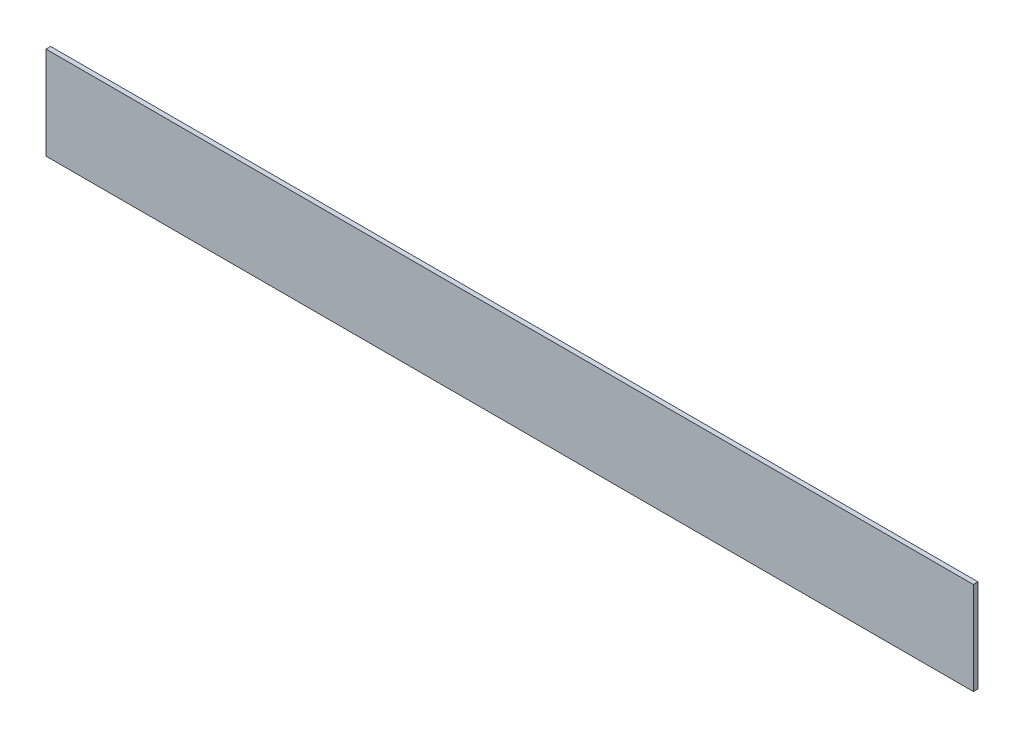
ISO-10303-21;
HEADER;
FILE_DESCRIPTION(('STEP AP214'),'2;1');
FILE_NAME('part.step','',(''),(''),'','','');
FILE_SCHEMA(('AUTOMOTIVE_DESIGN { 1 0 10303 214 1 1 1 1 }'));
ENDSEC;
DATA;
#1=APPLICATION_CONTEXT('core data for automotive mechanical design processes');
#2=APPLICATION_PROTOCOL_DEFINITION('international standard','automotive_design',2000,#1);
#3=PRODUCT_CONTEXT('',#1,'mechanical');
#4=PRODUCT('Part','Part','',(#3));
#5=PRODUCT_RELATED_PRODUCT_CATEGORY('part','',(#4));
#6=PRODUCT_DEFINITION_FORMATION('','',#4);
#7=PRODUCT_DEFINITION_CONTEXT('part definition',#1,'design');
#8=PRODUCT_DEFINITION('design','',#6,#7);
#9=PRODUCT_DEFINITION_SHAPE('','',#8);
#10=(LENGTH_UNIT() NAMED_UNIT(*) SI_UNIT(.MILLI.,.METRE.));
#11=(NAMED_UNIT(*) PLANE_ANGLE_UNIT() SI_UNIT($,.RADIAN.));
#12=(NAMED_UNIT(*) SI_UNIT($,.STERADIAN.) SOLID_ANGLE_UNIT());
#13=UNCERTAINTY_MEASURE_WITH_UNIT(LENGTH_MEASURE(1.E-05),#10,'distance_accuracy_value','');
#14=(GEOMETRIC_REPRESENTATION_CONTEXT(3) GLOBAL_UNCERTAINTY_ASSIGNED_CONTEXT((#13)) GLOBAL_UNIT_ASSIGNED_CONTEXT((#10,
#11,#12)) REPRESENTATION_CONTEXT('',''));
#15=CARTESIAN_POINT('',(0.,0.,0.));
#16=DIRECTION('',(0.,0.,1.));
#17=DIRECTION('',(1.,0.,0.));
#18=AXIS2_PLACEMENT_3D('',#15,#16,#17);
#19=CARTESIAN_POINT('',(0.,0.,-5.));
#20=DIRECTION('',(-1.,0.,0.));
#21=DIRECTION('',(0.,-1.,0.));
#22=AXIS2_PLACEMENT_3D('',#19,#20,#21);
#23=PLANE('',#22);
#24=DIRECTION('',(0.,-1.,0.));
#25=VECTOR('',#24,1.);
#26=CARTESIAN_POINT('',(0.,0.,0.));
#27=LINE('',#26,#25);
#28=CARTESIAN_POINT('',(0.,0.,0.));
#29=VERTEX_POINT('',#28);
#30=CARTESIAN_POINT('',(0.,-100.,0.));
#31=VERTEX_POINT('',#30);
#32=EDGE_CURVE('E102',#29,#31,#27,.T.);
#33=ORIENTED_EDGE('',*,*,#32,.F.);
#34=DIRECTION('',(0.,0.,1.));
#35=VECTOR('',#34,1.);
#36=CARTESIAN_POINT('',(0.,0.,-5.));
#37=LINE('',#36,#35);
#38=CARTESIAN_POINT('',(0.,0.,-5.));
#39=VERTEX_POINT('',#38);
#40=EDGE_CURVE('E11',#39,#29,#37,.T.);
#41=ORIENTED_EDGE('',*,*,#40,.F.);
#42=DIRECTION('',(0.,-1.,0.));
#43=VECTOR('',#42,1.);
#44=CARTESIAN_POINT('',(0.,0.,-5.));
#45=LINE('',#44,#43);
#46=CARTESIAN_POINT('',(0.,-100.,-5.));
#47=VERTEX_POINT('',#46);
#48=EDGE_CURVE('E96',#39,#47,#45,.T.);
#49=ORIENTED_EDGE('',*,*,#48,.T.);
#50=DIRECTION('',(0.,0.,1.));
#51=VECTOR('',#50,1.);
#52=CARTESIAN_POINT('',(0.,-100.,-5.));
#53=LINE('',#52,#51);
#54=EDGE_CURVE('E41',#47,#31,#53,.T.);
#55=ORIENTED_EDGE('',*,*,#54,.T.);
#56=EDGE_LOOP('',(#33,#41,#49,#55));
#57=FACE_BOUND('',#56,.T.);
#58=ADVANCED_FACE('F38',(#57),#23,.T.);
#59=CARTESIAN_POINT('',(0.,0.,-5.));
#60=DIRECTION('',(0.,1.,0.));
#61=DIRECTION('',(0.,0.,1.));
#62=AXIS2_PLACEMENT_3D('',#59,#60,#61);
#63=PLANE('',#62);
#64=DIRECTION('',(-1.,0.,0.));
#65=VECTOR('',#64,1.);
#66=CARTESIAN_POINT('',(0.,0.,0.));
#67=LINE('',#66,#65);
#68=CARTESIAN_POINT('',(1000.,0.,0.));
#69=VERTEX_POINT('',#68);
#70=EDGE_CURVE('E98',#69,#29,#67,.T.);
#71=ORIENTED_EDGE('',*,*,#70,.F.);
#72=DIRECTION('',(0.,0.,1.));
#73=VECTOR('',#72,1.);
#74=CARTESIAN_POINT('',(1000.,0.,-5.));
#75=LINE('',#74,#73);
#76=CARTESIAN_POINT('',(1000.,0.,-5.));
#77=VERTEX_POINT('',#76);
#78=EDGE_CURVE('E47',#77,#69,#75,.T.);
#79=ORIENTED_EDGE('',*,*,#78,.F.);
#80=DIRECTION('',(-1.,0.,0.));
#81=VECTOR('',#80,1.);
#82=CARTESIAN_POINT('',(0.,0.,-5.));
#83=LINE('',#82,#81);
#84=EDGE_CURVE('E93',#77,#39,#83,.T.);
#85=ORIENTED_EDGE('',*,*,#84,.T.);
#86=ORIENTED_EDGE('',*,*,#40,.T.);
#87=EDGE_LOOP('',(#71,#79,#85,#86));
#88=FACE_BOUND('',#87,.T.);
#89=ADVANCED_FACE('F112',(#88),#63,.T.);
#90=CARTESIAN_POINT('',(1000.,0.,-5.));
#91=DIRECTION('',(1.,0.,0.));
#92=DIRECTION('',(0.,0.,-1.));
#93=AXIS2_PLACEMENT_3D('',#90,#91,#92);
#94=PLANE('',#93);
#95=DIRECTION('',(0.,1.,0.));
#96=VECTOR('',#95,1.);
#97=CARTESIAN_POINT('',(1000.,0.,0.));
#98=LINE('',#97,#96);
#99=CARTESIAN_POINT('',(1000.,-100.,0.));
#100=VERTEX_POINT('',#99);
#101=EDGE_CURVE('E88',#100,#69,#98,.T.);
#102=ORIENTED_EDGE('',*,*,#101,.F.);
#103=DIRECTION('',(0.,0.,1.));
#104=VECTOR('',#103,1.);
#105=CARTESIAN_POINT('',(1000.,-100.,-5.));
#106=LINE('',#105,#104);
#107=CARTESIAN_POINT('',(1000.,-100.,-5.));
#108=VERTEX_POINT('',#107);
#109=EDGE_CURVE('E83',#108,#100,#106,.T.);
#110=ORIENTED_EDGE('',*,*,#109,.F.);
#111=DIRECTION('',(0.,1.,0.));
#112=VECTOR('',#111,1.);
#113=CARTESIAN_POINT('',(1000.,0.,-5.));
#114=LINE('',#113,#112);
#115=EDGE_CURVE('E86',#108,#77,#114,.T.);
#116=ORIENTED_EDGE('',*,*,#115,.T.);
#117=ORIENTED_EDGE('',*,*,#78,.T.);
#118=EDGE_LOOP('',(#102,#110,#116,#117));
#119=FACE_BOUND('',#118,.T.);
#120=ADVANCED_FACE('F85',(#119),#94,.T.);
#121=CARTESIAN_POINT('',(0.,-100.,-5.));
#122=DIRECTION('',(0.,-1.,0.));
#123=DIRECTION('',(0.,0.,-1.));
#124=AXIS2_PLACEMENT_3D('',#121,#122,#123);
#125=PLANE('',#124);
#126=DIRECTION('',(1.,0.,0.));
#127=VECTOR('',#126,1.);
#128=CARTESIAN_POINT('',(0.,-100.,0.));
#129=LINE('',#128,#127);
#130=EDGE_CURVE('E105',#31,#100,#129,.T.);
#131=ORIENTED_EDGE('',*,*,#130,.F.);
#132=ORIENTED_EDGE('',*,*,#54,.F.);
#133=DIRECTION('',(1.,0.,0.));
#134=VECTOR('',#133,1.);
#135=CARTESIAN_POINT('',(0.,-100.,-5.));
#136=LINE('',#135,#134);
#137=EDGE_CURVE('E92',#47,#108,#136,.T.);
#138=ORIENTED_EDGE('',*,*,#137,.T.);
#139=ORIENTED_EDGE('',*,*,#109,.T.);
#140=EDGE_LOOP('',(#131,#132,#138,#139));
#141=FACE_BOUND('',#140,.T.);
#142=ADVANCED_FACE('F95',(#141),#125,.T.);
#143=CARTESIAN_POINT('',(0.,0.,-5.));
#144=DIRECTION('',(0.,0.,1.));
#145=DIRECTION('',(1.,0.,0.));
#146=AXIS2_PLACEMENT_3D('',#143,#144,#145);
#147=PLANE('',#146);
#148=ORIENTED_EDGE('',*,*,#48,.F.);
#149=ORIENTED_EDGE('',*,*,#84,.F.);
#150=ORIENTED_EDGE('',*,*,#115,.F.);
#151=ORIENTED_EDGE('',*,*,#137,.F.);
#152=EDGE_LOOP('',(#148,#149,#150,#151));
#153=FACE_BOUND('',#152,.T.);
#154=ADVANCED_FACE('F91',(#153),#147,.F.);
#155=CARTESIAN_POINT('',(0.,0.,0.));
#156=DIRECTION('',(0.,0.,1.));
#157=DIRECTION('',(1.,0.,0.));
#158=AXIS2_PLACEMENT_3D('',#155,#156,#157);
#159=PLANE('',#158);
#160=ORIENTED_EDGE('',*,*,#32,.T.);
#161=ORIENTED_EDGE('',*,*,#130,.T.);
#162=ORIENTED_EDGE('',*,*,#101,.T.);
#163=ORIENTED_EDGE('',*,*,#70,.T.);
#164=EDGE_LOOP('',(#160,#161,#162,#163));
#165=FACE_BOUND('',#164,.T.);
#166=ADVANCED_FACE('F111',(#165),#159,.T.);
#167=CLOSED_SHELL('',(#58,#89,#120,#142,#154,#166));
#168=MANIFOLD_SOLID_BREP('B2',#167);
#169=ADVANCED_BREP_SHAPE_REPRESENTATION('',(#18,#168),#14);
#170=SHAPE_DEFINITION_REPRESENTATION(#9,#169);
ENDSEC;
END-ISO-10303-21;
